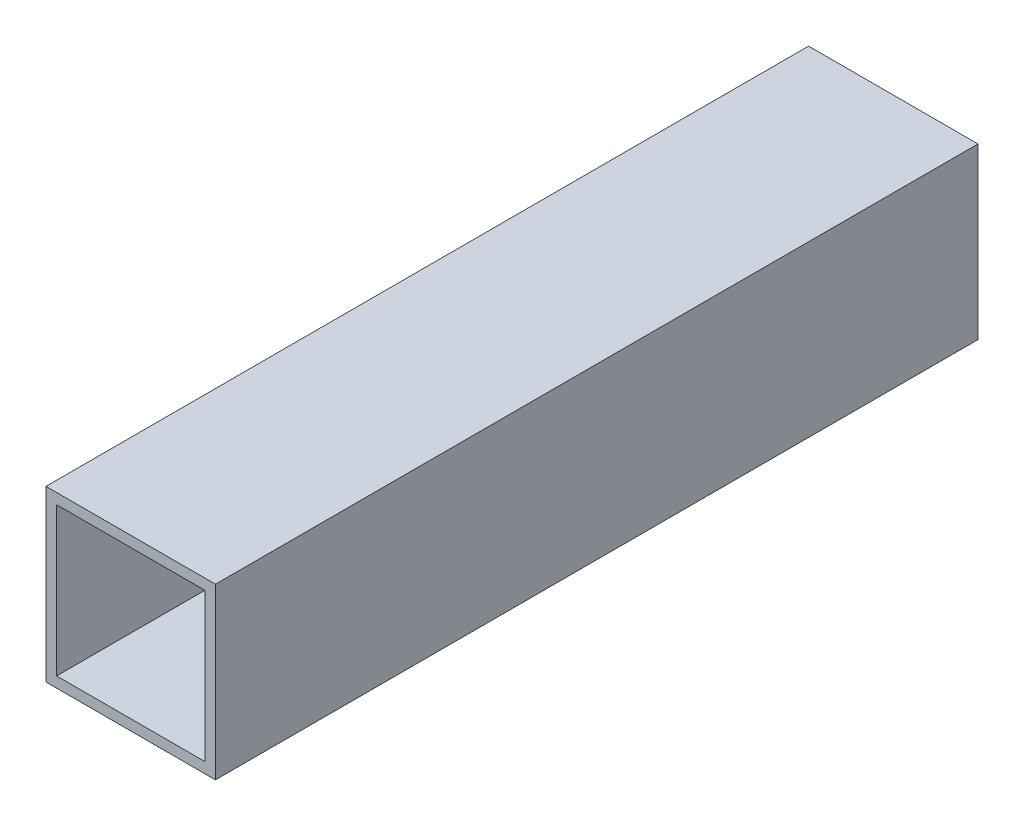
ISO-10303-21;
HEADER;
FILE_DESCRIPTION(('STEP AP214'),'2;1');
FILE_NAME('part.step','',(''),(''),'','','');
FILE_SCHEMA(('AUTOMOTIVE_DESIGN { 1 0 10303 214 1 1 1 1 }'));
ENDSEC;
DATA;
#1=APPLICATION_CONTEXT('core data for automotive mechanical design processes');
#2=APPLICATION_PROTOCOL_DEFINITION('international standard','automotive_design',2000,#1);
#3=PRODUCT_CONTEXT('',#1,'mechanical');
#4=PRODUCT('Part','Part','',(#3));
#5=PRODUCT_RELATED_PRODUCT_CATEGORY('part','',(#4));
#6=PRODUCT_DEFINITION_FORMATION('','',#4);
#7=PRODUCT_DEFINITION_CONTEXT('part definition',#1,'design');
#8=PRODUCT_DEFINITION('design','',#6,#7);
#9=PRODUCT_DEFINITION_SHAPE('','',#8);
#10=(LENGTH_UNIT() NAMED_UNIT(*) SI_UNIT(.MILLI.,.METRE.));
#11=(NAMED_UNIT(*) PLANE_ANGLE_UNIT() SI_UNIT($,.RADIAN.));
#12=(NAMED_UNIT(*) SI_UNIT($,.STERADIAN.) SOLID_ANGLE_UNIT());
#13=UNCERTAINTY_MEASURE_WITH_UNIT(LENGTH_MEASURE(1.E-05),#10,'distance_accuracy_value','');
#14=(GEOMETRIC_REPRESENTATION_CONTEXT(3) GLOBAL_UNCERTAINTY_ASSIGNED_CONTEXT((#13)) GLOBAL_UNIT_ASSIGNED_CONTEXT((#10,
#11,#12)) REPRESENTATION_CONTEXT('',''));
#15=CARTESIAN_POINT('',(0.,0.,0.));
#16=DIRECTION('',(0.,0.,1.));
#17=DIRECTION('',(1.,0.,0.));
#18=AXIS2_PLACEMENT_3D('',#15,#16,#17);
#19=CARTESIAN_POINT('',(0.,0.,-228.6));
#20=DIRECTION('',(0.,0.,1.));
#21=DIRECTION('',(-1.,0.,0.));
#22=AXIS2_PLACEMENT_3D('',#19,#20,#21);
#23=PLANE('',#22);
#24=DIRECTION('',(0.,-1.,0.));
#25=VECTOR('',#24,1.);
#26=CARTESIAN_POINT('',(0.,0.,-228.6));
#27=LINE('',#26,#25);
#28=CARTESIAN_POINT('',(0.,50.8,-228.6));
#29=VERTEX_POINT('',#28);
#30=CARTESIAN_POINT('',(0.,0.,-228.6));
#31=VERTEX_POINT('',#30);
#32=EDGE_CURVE('E136',#29,#31,#27,.T.);
#33=ORIENTED_EDGE('',*,*,#32,.F.);
#34=DIRECTION('',(-1.,0.,0.));
#35=VECTOR('',#34,1.);
#36=CARTESIAN_POINT('',(0.,50.8,-228.6));
#37=LINE('',#36,#35);
#38=CARTESIAN_POINT('',(50.8,50.8,-228.6));
#39=VERTEX_POINT('',#38);
#40=EDGE_CURVE('E146',#39,#29,#37,.T.);
#41=ORIENTED_EDGE('',*,*,#40,.F.);
#42=DIRECTION('',(0.,1.,0.));
#43=VECTOR('',#42,1.);
#44=CARTESIAN_POINT('',(50.8,0.,-228.6));
#45=LINE('',#44,#43);
#46=CARTESIAN_POINT('',(50.8,0.,-228.6));
#47=VERTEX_POINT('',#46);
#48=EDGE_CURVE('E143',#47,#39,#45,.T.);
#49=ORIENTED_EDGE('',*,*,#48,.F.);
#50=DIRECTION('',(1.,0.,0.));
#51=VECTOR('',#50,1.);
#52=CARTESIAN_POINT('',(0.,0.,-228.6));
#53=LINE('',#52,#51);
#54=EDGE_CURVE('E139',#31,#47,#53,.T.);
#55=ORIENTED_EDGE('',*,*,#54,.F.);
#56=EDGE_LOOP('',(#33,#41,#49,#55));
#57=FACE_BOUND('',#56,.T.);
#58=DIRECTION('',(0.,-1.,0.));
#59=VECTOR('',#58,1.);
#60=CARTESIAN_POINT('',(3.175,3.175,-228.6));
#61=LINE('',#60,#59);
#62=CARTESIAN_POINT('',(3.175,47.625,-228.6));
#63=VERTEX_POINT('',#62);
#64=CARTESIAN_POINT('',(3.175,3.175,-228.6));
#65=VERTEX_POINT('',#64);
#66=EDGE_CURVE('E104',#63,#65,#61,.T.);
#67=ORIENTED_EDGE('',*,*,#66,.T.);
#68=DIRECTION('',(1.,0.,0.));
#69=VECTOR('',#68,1.);
#70=CARTESIAN_POINT('',(3.175,3.175,-228.6));
#71=LINE('',#70,#69);
#72=CARTESIAN_POINT('',(47.625,3.175,-228.6));
#73=VERTEX_POINT('',#72);
#74=EDGE_CURVE('E113',#65,#73,#71,.T.);
#75=ORIENTED_EDGE('',*,*,#74,.T.);
#76=DIRECTION('',(0.,1.,0.));
#77=VECTOR('',#76,1.);
#78=CARTESIAN_POINT('',(47.625,3.175,-228.6));
#79=LINE('',#78,#77);
#80=CARTESIAN_POINT('',(47.625,47.625,-228.6));
#81=VERTEX_POINT('',#80);
#82=EDGE_CURVE('E117',#73,#81,#79,.T.);
#83=ORIENTED_EDGE('',*,*,#82,.T.);
#84=DIRECTION('',(-1.,0.,0.));
#85=VECTOR('',#84,1.);
#86=CARTESIAN_POINT('',(3.175,47.625,-228.6));
#87=LINE('',#86,#85);
#88=EDGE_CURVE('E120',#81,#63,#87,.T.);
#89=ORIENTED_EDGE('',*,*,#88,.T.);
#90=EDGE_LOOP('',(#67,#75,#83,#89));
#91=FACE_BOUND('',#90,.T.);
#92=ADVANCED_FACE('F37',(#57,#91),#23,.F.);
#93=CARTESIAN_POINT('',(0.,0.,0.));
#94=DIRECTION('',(0.,0.,1.));
#95=DIRECTION('',(-1.,0.,0.));
#96=AXIS2_PLACEMENT_3D('',#93,#94,#95);
#97=PLANE('',#96);
#98=DIRECTION('',(0.,-1.,0.));
#99=VECTOR('',#98,1.);
#100=CARTESIAN_POINT('',(0.,0.,0.));
#101=LINE('',#100,#99);
#102=CARTESIAN_POINT('',(0.,50.8,0.));
#103=VERTEX_POINT('',#102);
#104=CARTESIAN_POINT('',(0.,0.,0.));
#105=VERTEX_POINT('',#104);
#106=EDGE_CURVE('E109',#103,#105,#101,.T.);
#107=ORIENTED_EDGE('',*,*,#106,.T.);
#108=DIRECTION('',(1.,0.,0.));
#109=VECTOR('',#108,1.);
#110=CARTESIAN_POINT('',(0.,0.,0.));
#111=LINE('',#110,#109);
#112=CARTESIAN_POINT('',(50.8,0.,0.));
#113=VERTEX_POINT('',#112);
#114=EDGE_CURVE('E152',#105,#113,#111,.T.);
#115=ORIENTED_EDGE('',*,*,#114,.T.);
#116=DIRECTION('',(0.,1.,0.));
#117=VECTOR('',#116,1.);
#118=CARTESIAN_POINT('',(50.8,0.,0.));
#119=LINE('',#118,#117);
#120=CARTESIAN_POINT('',(50.8,50.8,0.));
#121=VERTEX_POINT('',#120);
#122=EDGE_CURVE('E155',#113,#121,#119,.T.);
#123=ORIENTED_EDGE('',*,*,#122,.T.);
#124=DIRECTION('',(-1.,0.,0.));
#125=VECTOR('',#124,1.);
#126=CARTESIAN_POINT('',(0.,50.8,0.));
#127=LINE('',#126,#125);
#128=EDGE_CURVE('E140',#121,#103,#127,.T.);
#129=ORIENTED_EDGE('',*,*,#128,.T.);
#130=EDGE_LOOP('',(#107,#115,#123,#129));
#131=FACE_BOUND('',#130,.T.);
#132=DIRECTION('',(-1.,0.,0.));
#133=VECTOR('',#132,1.);
#134=CARTESIAN_POINT('',(3.175,47.625,0.));
#135=LINE('',#134,#133);
#136=CARTESIAN_POINT('',(47.625,47.625,0.));
#137=VERTEX_POINT('',#136);
#138=CARTESIAN_POINT('',(3.175,47.625,0.));
#139=VERTEX_POINT('',#138);
#140=EDGE_CURVE('E121',#137,#139,#135,.T.);
#141=ORIENTED_EDGE('',*,*,#140,.F.);
#142=DIRECTION('',(0.,1.,0.));
#143=VECTOR('',#142,1.);
#144=CARTESIAN_POINT('',(47.625,3.175,0.));
#145=LINE('',#144,#143);
#146=CARTESIAN_POINT('',(47.625,3.175,0.));
#147=VERTEX_POINT('',#146);
#148=EDGE_CURVE('E124',#147,#137,#145,.T.);
#149=ORIENTED_EDGE('',*,*,#148,.F.);
#150=DIRECTION('',(1.,0.,0.));
#151=VECTOR('',#150,1.);
#152=CARTESIAN_POINT('',(3.175,3.175,0.));
#153=LINE('',#152,#151);
#154=CARTESIAN_POINT('',(3.175,3.175,0.));
#155=VERTEX_POINT('',#154);
#156=EDGE_CURVE('E130',#155,#147,#153,.T.);
#157=ORIENTED_EDGE('',*,*,#156,.F.);
#158=DIRECTION('',(0.,-1.,0.));
#159=VECTOR('',#158,1.);
#160=CARTESIAN_POINT('',(3.175,3.175,0.));
#161=LINE('',#160,#159);
#162=EDGE_CURVE('E105',#139,#155,#161,.T.);
#163=ORIENTED_EDGE('',*,*,#162,.F.);
#164=EDGE_LOOP('',(#141,#149,#157,#163));
#165=FACE_BOUND('',#164,.T.);
#166=ADVANCED_FACE('F172',(#131,#165),#97,.T.);
#167=CARTESIAN_POINT('',(0.,0.,-228.6));
#168=DIRECTION('',(1.,0.,0.));
#169=DIRECTION('',(0.,0.,1.));
#170=AXIS2_PLACEMENT_3D('',#167,#168,#169);
#171=PLANE('',#170);
#172=ORIENTED_EDGE('',*,*,#106,.F.);
#173=DIRECTION('',(0.,0.,1.));
#174=VECTOR('',#173,1.);
#175=CARTESIAN_POINT('',(0.,50.8,-228.6));
#176=LINE('',#175,#174);
#177=EDGE_CURVE('E149',#29,#103,#176,.T.);
#178=ORIENTED_EDGE('',*,*,#177,.F.);
#179=ORIENTED_EDGE('',*,*,#32,.T.);
#180=DIRECTION('',(0.,0.,1.));
#181=VECTOR('',#180,1.);
#182=CARTESIAN_POINT('',(0.,0.,-228.6));
#183=LINE('',#182,#181);
#184=EDGE_CURVE('E11',#31,#105,#183,.T.);
#185=ORIENTED_EDGE('',*,*,#184,.T.);
#186=EDGE_LOOP('',(#172,#178,#179,#185));
#187=FACE_BOUND('',#186,.T.);
#188=ADVANCED_FACE('F39',(#187),#171,.F.);
#189=CARTESIAN_POINT('',(0.,0.,-228.6));
#190=DIRECTION('',(0.,1.,0.));
#191=DIRECTION('',(0.,0.,-1.));
#192=AXIS2_PLACEMENT_3D('',#189,#190,#191);
#193=PLANE('',#192);
#194=ORIENTED_EDGE('',*,*,#114,.F.);
#195=ORIENTED_EDGE('',*,*,#184,.F.);
#196=ORIENTED_EDGE('',*,*,#54,.T.);
#197=DIRECTION('',(0.,0.,1.));
#198=VECTOR('',#197,1.);
#199=CARTESIAN_POINT('',(50.8,0.,-228.6));
#200=LINE('',#199,#198);
#201=EDGE_CURVE('E45',#47,#113,#200,.T.);
#202=ORIENTED_EDGE('',*,*,#201,.T.);
#203=EDGE_LOOP('',(#194,#195,#196,#202));
#204=FACE_BOUND('',#203,.T.);
#205=ADVANCED_FACE('F165',(#204),#193,.F.);
#206=CARTESIAN_POINT('',(50.8,0.,-228.6));
#207=DIRECTION('',(-1.,0.,0.));
#208=DIRECTION('',(0.,0.,-1.));
#209=AXIS2_PLACEMENT_3D('',#206,#207,#208);
#210=PLANE('',#209);
#211=ORIENTED_EDGE('',*,*,#122,.F.);
#212=ORIENTED_EDGE('',*,*,#201,.F.);
#213=ORIENTED_EDGE('',*,*,#48,.T.);
#214=DIRECTION('',(0.,0.,1.));
#215=VECTOR('',#214,1.);
#216=CARTESIAN_POINT('',(50.8,50.8,-228.6));
#217=LINE('',#216,#215);
#218=EDGE_CURVE('E161',#39,#121,#217,.T.);
#219=ORIENTED_EDGE('',*,*,#218,.T.);
#220=EDGE_LOOP('',(#211,#212,#213,#219));
#221=FACE_BOUND('',#220,.T.);
#222=ADVANCED_FACE('F169',(#221),#210,.F.);
#223=CARTESIAN_POINT('',(0.,50.8,-228.6));
#224=DIRECTION('',(0.,-1.,0.));
#225=DIRECTION('',(0.,0.,1.));
#226=AXIS2_PLACEMENT_3D('',#223,#224,#225);
#227=PLANE('',#226);
#228=ORIENTED_EDGE('',*,*,#128,.F.);
#229=ORIENTED_EDGE('',*,*,#218,.F.);
#230=ORIENTED_EDGE('',*,*,#40,.T.);
#231=ORIENTED_EDGE('',*,*,#177,.T.);
#232=EDGE_LOOP('',(#228,#229,#230,#231));
#233=FACE_BOUND('',#232,.T.);
#234=ADVANCED_FACE('F180',(#233),#227,.F.);
#235=CARTESIAN_POINT('',(3.175,3.175,-228.6));
#236=DIRECTION('',(1.,0.,0.));
#237=DIRECTION('',(0.,0.,1.));
#238=AXIS2_PLACEMENT_3D('',#235,#236,#237);
#239=PLANE('',#238);
#240=ORIENTED_EDGE('',*,*,#162,.T.);
#241=DIRECTION('',(0.,0.,1.));
#242=VECTOR('',#241,1.);
#243=CARTESIAN_POINT('',(3.175,3.175,-228.6));
#244=LINE('',#243,#242);
#245=EDGE_CURVE('E100',#65,#155,#244,.T.);
#246=ORIENTED_EDGE('',*,*,#245,.F.);
#247=ORIENTED_EDGE('',*,*,#66,.F.);
#248=DIRECTION('',(0.,0.,1.));
#249=VECTOR('',#248,1.);
#250=CARTESIAN_POINT('',(3.175,47.625,-228.6));
#251=LINE('',#250,#249);
#252=EDGE_CURVE('E60',#63,#139,#251,.T.);
#253=ORIENTED_EDGE('',*,*,#252,.T.);
#254=EDGE_LOOP('',(#240,#246,#247,#253));
#255=FACE_BOUND('',#254,.T.);
#256=ADVANCED_FACE('F102',(#255),#239,.T.);
#257=CARTESIAN_POINT('',(3.175,3.175,-228.6));
#258=DIRECTION('',(0.,1.,0.));
#259=DIRECTION('',(0.,0.,-1.));
#260=AXIS2_PLACEMENT_3D('',#257,#258,#259);
#261=PLANE('',#260);
#262=ORIENTED_EDGE('',*,*,#156,.T.);
#263=DIRECTION('',(0.,0.,1.));
#264=VECTOR('',#263,1.);
#265=CARTESIAN_POINT('',(47.625,3.175,-228.6));
#266=LINE('',#265,#264);
#267=EDGE_CURVE('E110',#73,#147,#266,.T.);
#268=ORIENTED_EDGE('',*,*,#267,.F.);
#269=ORIENTED_EDGE('',*,*,#74,.F.);
#270=ORIENTED_EDGE('',*,*,#245,.T.);
#271=EDGE_LOOP('',(#262,#268,#269,#270));
#272=FACE_BOUND('',#271,.T.);
#273=ADVANCED_FACE('F114',(#272),#261,.T.);
#274=CARTESIAN_POINT('',(47.625,3.175,-228.6));
#275=DIRECTION('',(-1.,0.,0.));
#276=DIRECTION('',(0.,0.,-1.));
#277=AXIS2_PLACEMENT_3D('',#274,#275,#276);
#278=PLANE('',#277);
#279=ORIENTED_EDGE('',*,*,#148,.T.);
#280=DIRECTION('',(0.,0.,1.));
#281=VECTOR('',#280,1.);
#282=CARTESIAN_POINT('',(47.625,47.625,-228.6));
#283=LINE('',#282,#281);
#284=EDGE_CURVE('E52',#81,#137,#283,.T.);
#285=ORIENTED_EDGE('',*,*,#284,.F.);
#286=ORIENTED_EDGE('',*,*,#82,.F.);
#287=ORIENTED_EDGE('',*,*,#267,.T.);
#288=EDGE_LOOP('',(#279,#285,#286,#287));
#289=FACE_BOUND('',#288,.T.);
#290=ADVANCED_FACE('F198',(#289),#278,.T.);
#291=CARTESIAN_POINT('',(3.175,47.625,-228.6));
#292=DIRECTION('',(0.,-1.,0.));
#293=DIRECTION('',(0.,0.,1.));
#294=AXIS2_PLACEMENT_3D('',#291,#292,#293);
#295=PLANE('',#294);
#296=ORIENTED_EDGE('',*,*,#140,.T.);
#297=ORIENTED_EDGE('',*,*,#252,.F.);
#298=ORIENTED_EDGE('',*,*,#88,.F.);
#299=ORIENTED_EDGE('',*,*,#284,.T.);
#300=EDGE_LOOP('',(#296,#297,#298,#299));
#301=FACE_BOUND('',#300,.T.);
#302=ADVANCED_FACE('F201',(#301),#295,.T.);
#303=CLOSED_SHELL('',(#92,#166,#188,#205,#222,#234,#256,#273,#290,#302));
#304=MANIFOLD_SOLID_BREP('B2',#303);
#305=ADVANCED_BREP_SHAPE_REPRESENTATION('',(#18,#304),#14);
#306=SHAPE_DEFINITION_REPRESENTATION(#9,#305);
ENDSEC;
END-ISO-10303-21;
